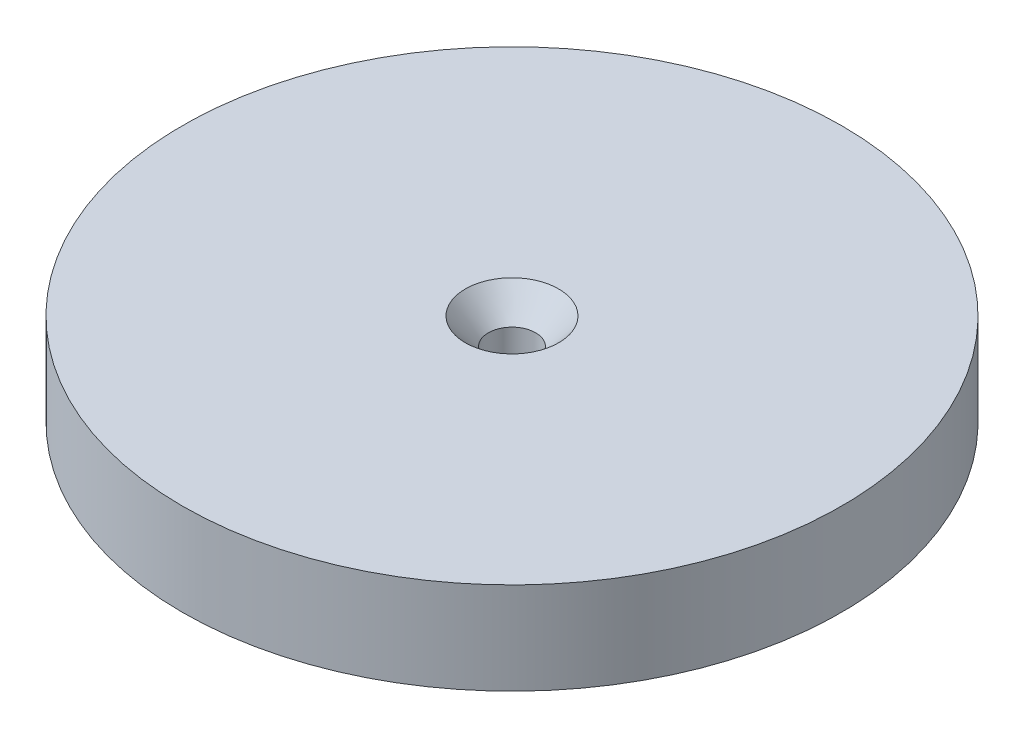
ISO-10303-21;
HEADER;
FILE_DESCRIPTION(('STEP AP214'),'2;1');
FILE_NAME('part.step','',(''),(''),'','','');
FILE_SCHEMA(('AUTOMOTIVE_DESIGN { 1 0 10303 214 1 1 1 1 }'));
ENDSEC;
DATA;
#1=APPLICATION_CONTEXT('core data for automotive mechanical design processes');
#2=APPLICATION_PROTOCOL_DEFINITION('international standard','automotive_design',2000,#1);
#3=PRODUCT_CONTEXT('',#1,'mechanical');
#4=PRODUCT('Part','Part','',(#3));
#5=PRODUCT_RELATED_PRODUCT_CATEGORY('part','',(#4));
#6=PRODUCT_DEFINITION_FORMATION('','',#4);
#7=PRODUCT_DEFINITION_CONTEXT('part definition',#1,'design');
#8=PRODUCT_DEFINITION('design','',#6,#7);
#9=PRODUCT_DEFINITION_SHAPE('','',#8);
#10=(LENGTH_UNIT() NAMED_UNIT(*) SI_UNIT(.MILLI.,.METRE.));
#11=(NAMED_UNIT(*) PLANE_ANGLE_UNIT() SI_UNIT($,.RADIAN.));
#12=(NAMED_UNIT(*) SI_UNIT($,.STERADIAN.) SOLID_ANGLE_UNIT());
#13=UNCERTAINTY_MEASURE_WITH_UNIT(LENGTH_MEASURE(1.E-05),#10,'distance_accuracy_value','');
#14=(GEOMETRIC_REPRESENTATION_CONTEXT(3) GLOBAL_UNCERTAINTY_ASSIGNED_CONTEXT((#13)) GLOBAL_UNIT_ASSIGNED_CONTEXT((#10,
#11,#12)) REPRESENTATION_CONTEXT('',''));
#15=CARTESIAN_POINT('',(0.,0.,0.));
#16=DIRECTION('',(0.,0.,1.));
#17=DIRECTION('',(1.,0.,0.));
#18=AXIS2_PLACEMENT_3D('',#15,#16,#17);
#19=CARTESIAN_POINT('',(0.,25.4,0.));
#20=DIRECTION('',(0.,-1.,0.));
#21=DIRECTION('',(0.,0.,-1.));
#22=AXIS2_PLACEMENT_3D('',#19,#20,#21);
#23=CYLINDRICAL_SURFACE('',#22,45.466);
#24=CARTESIAN_POINT('',(0.,25.4,0.));
#25=DIRECTION('',(0.,1.,0.));
#26=DIRECTION('',(0.,0.,1.));
#27=AXIS2_PLACEMENT_3D('',#24,#25,#26);
#28=CIRCLE('',#27,45.466);
#29=CARTESIAN_POINT('',(0.,25.4,45.466));
#30=VERTEX_POINT('',#29);
#31=EDGE_CURVE('E10',#30,#30,#28,.T.);
#32=ORIENTED_EDGE('',*,*,#31,.F.);
#33=EDGE_LOOP('',(#32));
#34=FACE_BOUND('',#33,.T.);
#35=CARTESIAN_POINT('',(0.,12.7,0.));
#36=DIRECTION('',(0.,-1.,0.));
#37=DIRECTION('',(0.,0.,-1.));
#38=AXIS2_PLACEMENT_3D('',#35,#36,#37);
#39=CIRCLE('',#38,45.466);
#40=CARTESIAN_POINT('',(0.,12.7,-45.466));
#41=VERTEX_POINT('',#40);
#42=EDGE_CURVE('E57',#41,#41,#39,.T.);
#43=ORIENTED_EDGE('',*,*,#42,.F.);
#44=EDGE_LOOP('',(#43));
#45=FACE_BOUND('',#44,.T.);
#46=ADVANCED_FACE('F36',(#34,#45),#23,.T.);
#47=CARTESIAN_POINT('',(0.,25.4,0.));
#48=DIRECTION('',(0.,1.,0.));
#49=DIRECTION('',(0.,0.,1.));
#50=AXIS2_PLACEMENT_3D('',#47,#48,#49);
#51=PLANE('',#50);
#52=CARTESIAN_POINT('',(0.,25.4,0.));
#53=DIRECTION('',(0.,1.,0.));
#54=DIRECTION('',(0.,0.,1.));
#55=AXIS2_PLACEMENT_3D('',#52,#53,#54);
#56=CIRCLE('',#55,6.4389);
#57=CARTESIAN_POINT('',(0.,25.4,6.4389));
#58=VERTEX_POINT('',#57);
#59=EDGE_CURVE('E53',#58,#58,#56,.T.);
#60=ORIENTED_EDGE('',*,*,#59,.F.);
#61=EDGE_LOOP('',(#60));
#62=FACE_BOUND('',#61,.T.);
#63=ORIENTED_EDGE('',*,*,#31,.T.);
#64=EDGE_LOOP('',(#63));
#65=FACE_BOUND('',#64,.T.);
#66=ADVANCED_FACE('F65',(#62,#65),#51,.T.);
#67=CARTESIAN_POINT('',(0.,12.7,0.));
#68=DIRECTION('',(0.,-1.,0.));
#69=DIRECTION('',(0.,0.,-1.));
#70=AXIS2_PLACEMENT_3D('',#67,#68,#69);
#71=PLANE('',#70);
#72=CARTESIAN_POINT('',(0.,12.7,0.));
#73=DIRECTION('',(0.,-1.,0.));
#74=DIRECTION('',(0.,0.,-1.));
#75=AXIS2_PLACEMENT_3D('',#72,#73,#74);
#76=CIRCLE('',#75,3.26389999999999);
#77=CARTESIAN_POINT('',(0.,12.7,-3.26389999999999));
#78=VERTEX_POINT('',#77);
#79=EDGE_CURVE('E39',#78,#78,#76,.T.);
#80=ORIENTED_EDGE('',*,*,#79,.F.);
#81=EDGE_LOOP('',(#80));
#82=FACE_BOUND('',#81,.T.);
#83=ORIENTED_EDGE('',*,*,#42,.T.);
#84=EDGE_LOOP('',(#83));
#85=FACE_BOUND('',#84,.T.);
#86=ADVANCED_FACE('F62',(#82,#85),#71,.T.);
#87=CARTESIAN_POINT('',(0.,25.4,0.));
#88=DIRECTION('',(0.,1.,0.));
#89=DIRECTION('',(0.,0.,1.));
#90=AXIS2_PLACEMENT_3D('',#87,#88,#89);
#91=CYLINDRICAL_SURFACE('',#90,3.26389999999999);
#92=ORIENTED_EDGE('',*,*,#79,.T.);
#93=EDGE_LOOP('',(#92));
#94=FACE_BOUND('',#93,.T.);
#95=CARTESIAN_POINT('',(0.,21.7475803070733,0.));
#96=DIRECTION('',(0.,1.,0.));
#97=DIRECTION('',(0.,0.,1.));
#98=AXIS2_PLACEMENT_3D('',#95,#96,#97);
#99=CIRCLE('',#98,3.2639);
#100=CARTESIAN_POINT('',(0.,21.7475803070733,3.2639));
#101=VERTEX_POINT('',#100);
#102=EDGE_CURVE('E48',#101,#101,#99,.T.);
#103=ORIENTED_EDGE('',*,*,#102,.T.);
#104=EDGE_LOOP('',(#103));
#105=FACE_BOUND('',#104,.T.);
#106=ADVANCED_FACE('F77',(#94,#105),#91,.F.);
#107=CARTESIAN_POINT('',(0.,25.4,0.));
#108=DIRECTION('',(0.,1.,0.));
#109=DIRECTION('',(0.,0.,1.));
#110=AXIS2_PLACEMENT_3D('',#107,#108,#109);
#111=CONICAL_SURFACE('',#110,6.4389,0.715584993317675);
#112=ORIENTED_EDGE('',*,*,#102,.F.);
#113=EDGE_LOOP('',(#112));
#114=FACE_BOUND('',#113,.T.);
#115=ORIENTED_EDGE('',*,*,#59,.T.);
#116=EDGE_LOOP('',(#115));
#117=FACE_BOUND('',#116,.T.);
#118=ADVANCED_FACE('F84',(#114,#117),#111,.F.);
#119=CLOSED_SHELL('',(#46,#66,#86,#106,#118));
#120=MANIFOLD_SOLID_BREP('B2',#119);
#121=ADVANCED_BREP_SHAPE_REPRESENTATION('',(#18,#120),#14);
#122=SHAPE_DEFINITION_REPRESENTATION(#9,#121);
ENDSEC;
END-ISO-10303-21;
